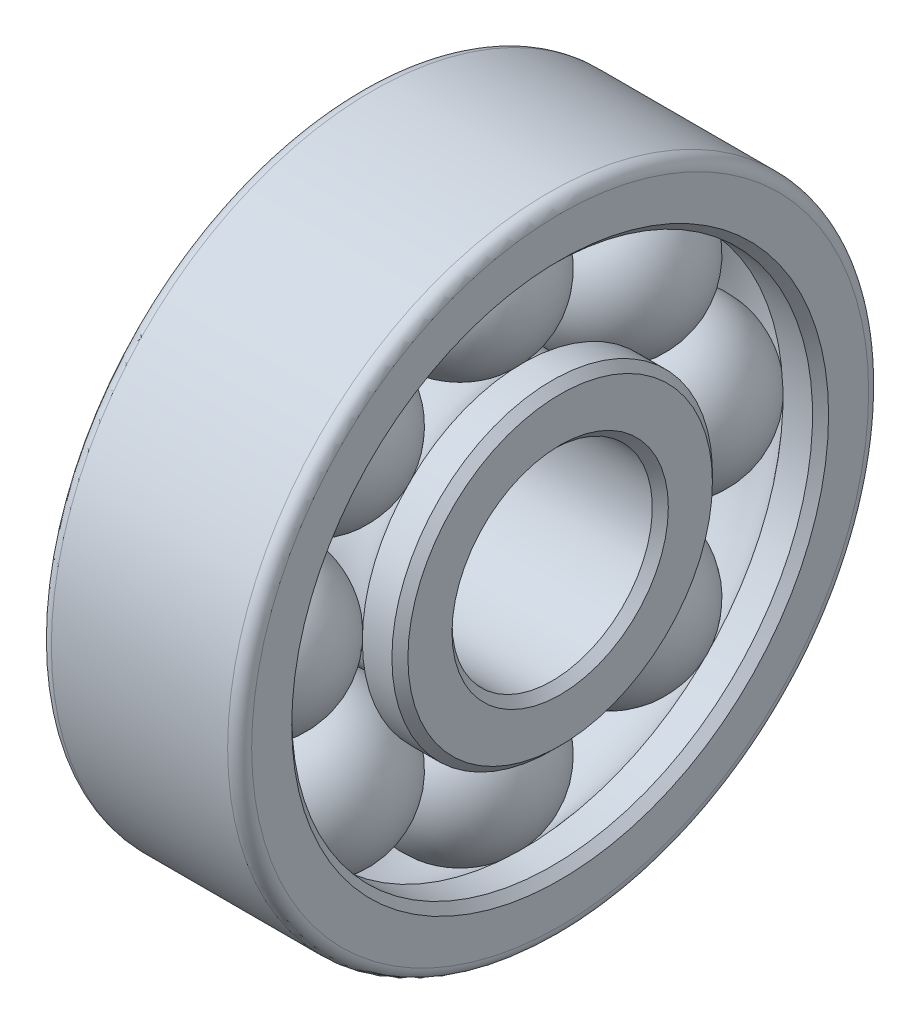
ISO-10303-21;
HEADER;
FILE_DESCRIPTION(('STEP AP214'),'2;1');
FILE_NAME('part.step','',(''),(''),'','','');
FILE_SCHEMA(('AUTOMOTIVE_DESIGN { 1 0 10303 214 1 1 1 1 }'));
ENDSEC;
DATA;
#1=APPLICATION_CONTEXT('core data for automotive mechanical design processes');
#2=APPLICATION_PROTOCOL_DEFINITION('international standard','automotive_design',2000,#1);
#3=PRODUCT_CONTEXT('',#1,'mechanical');
#4=PRODUCT('Part','Part','',(#3));
#5=PRODUCT_RELATED_PRODUCT_CATEGORY('part','',(#4));
#6=PRODUCT_DEFINITION_FORMATION('','',#4);
#7=PRODUCT_DEFINITION_CONTEXT('part definition',#1,'design');
#8=PRODUCT_DEFINITION('design','',#6,#7);
#9=PRODUCT_DEFINITION_SHAPE('','',#8);
#10=(LENGTH_UNIT() NAMED_UNIT(*) SI_UNIT(.MILLI.,.METRE.));
#11=(NAMED_UNIT(*) PLANE_ANGLE_UNIT() SI_UNIT($,.RADIAN.));
#12=(NAMED_UNIT(*) SI_UNIT($,.STERADIAN.) SOLID_ANGLE_UNIT());
#13=UNCERTAINTY_MEASURE_WITH_UNIT(LENGTH_MEASURE(1.E-05),#10,'distance_accuracy_value','');
#14=(GEOMETRIC_REPRESENTATION_CONTEXT(3) GLOBAL_UNCERTAINTY_ASSIGNED_CONTEXT((#13)) GLOBAL_UNIT_ASSIGNED_CONTEXT((#10,
#11,#12)) REPRESENTATION_CONTEXT('',''));
#15=CARTESIAN_POINT('',(0.,0.,0.));
#16=DIRECTION('',(0.,0.,1.));
#17=DIRECTION('',(1.,0.,0.));
#18=AXIS2_PLACEMENT_3D('',#15,#16,#17);
#19=CARTESIAN_POINT('',(2.5,1.21231060122942,3.71231060122933));
#20=DIRECTION('',(0.,0.707106781186556,0.707106781186539));
#21=DIRECTION('',(1.,0.,0.));
#22=AXIS2_PLACEMENT_3D('',#19,#20,#21);
#23=SPHERICAL_SURFACE('',#22,2.);
#24=CARTESIAN_POINT('',(2.5,2.62652416360253,5.12652416360241));
#25=VERTEX_POINT('',#24);
#26=VERTEX_LOOP('',#25);
#27=FACE_BOUND('',#26,.T.);
#28=ADVANCED_FACE('F46',(#27),#23,.T.);
#29=CLOSED_SHELL('',(#28));
#30=MANIFOLD_SOLID_BREP('B2',#29);
#31=CARTESIAN_POINT('',(2.5,-2.49999999999995,5.25));
#32=DIRECTION('',(0.,0.,1.));
#33=DIRECTION('',(1.,0.,0.));
#34=AXIS2_PLACEMENT_3D('',#31,#32,#33);
#35=SPHERICAL_SURFACE('',#34,2.);
#36=CARTESIAN_POINT('',(2.5,-2.49999999999992,7.25));
#37=VERTEX_POINT('',#36);
#38=VERTEX_LOOP('',#37);
#39=FACE_BOUND('',#38,.T.);
#40=ADVANCED_FACE('F70',(#39),#35,.T.);
#41=CLOSED_SHELL('',(#40));
#42=MANIFOLD_SOLID_BREP('B7',#41);
#43=CARTESIAN_POINT('',(2.5,-6.21231060122934,3.71231060122941));
#44=DIRECTION('',(0.,-0.707106781186541,0.707106781186554));
#45=DIRECTION('',(1.,0.,0.));
#46=AXIS2_PLACEMENT_3D('',#43,#44,#45);
#47=SPHERICAL_SURFACE('',#46,2.);
#48=CARTESIAN_POINT('',(2.5,-7.62652416360243,5.12652416360252));
#49=VERTEX_POINT('',#48);
#50=VERTEX_LOOP('',#49);
#51=FACE_BOUND('',#50,.T.);
#52=ADVANCED_FACE('F94',(#51),#47,.T.);
#53=CLOSED_SHELL('',(#52));
#54=MANIFOLD_SOLID_BREP('B42',#53);
#55=CARTESIAN_POINT('',(2.5,-7.75,0.));
#56=DIRECTION('',(0.,-1.,0.));
#57=DIRECTION('',(1.,0.,0.));
#58=AXIS2_PLACEMENT_3D('',#55,#56,#57);
#59=SPHERICAL_SURFACE('',#58,2.);
#60=CARTESIAN_POINT('',(2.5,-9.75,0.));
#61=VERTEX_POINT('',#60);
#62=VERTEX_LOOP('',#61);
#63=FACE_BOUND('',#62,.T.);
#64=ADVANCED_FACE('F118',(#63),#59,.T.);
#65=CLOSED_SHELL('',(#64));
#66=MANIFOLD_SOLID_BREP('B66',#65);
#67=CARTESIAN_POINT('',(2.5,-6.21231060122939,-3.71231060122936));
#68=DIRECTION('',(0.,-0.707106781186551,-0.707106781186544));
#69=DIRECTION('',(1.,0.,0.));
#70=AXIS2_PLACEMENT_3D('',#67,#68,#69);
#71=SPHERICAL_SURFACE('',#70,2.);
#72=CARTESIAN_POINT('',(2.5,-7.6265241636025,-5.12652416360244));
#73=VERTEX_POINT('',#72);
#74=VERTEX_LOOP('',#73);
#75=FACE_BOUND('',#74,.T.);
#76=ADVANCED_FACE('F142',(#75),#71,.T.);
#77=CLOSED_SHELL('',(#76));
#78=MANIFOLD_SOLID_BREP('B90',#77);
#79=CARTESIAN_POINT('',(2.5,-2.50000000000002,-5.25));
#80=DIRECTION('',(0.,0.,-1.));
#81=DIRECTION('',(1.,0.,0.));
#82=AXIS2_PLACEMENT_3D('',#79,#80,#81);
#83=SPHERICAL_SURFACE('',#82,2.);
#84=CARTESIAN_POINT('',(2.5,-2.50000000000003,-7.25));
#85=VERTEX_POINT('',#84);
#86=VERTEX_LOOP('',#85);
#87=FACE_BOUND('',#86,.T.);
#88=ADVANCED_FACE('F166',(#87),#83,.T.);
#89=CLOSED_SHELL('',(#88));
#90=MANIFOLD_SOLID_BREP('B114',#89);
#91=CARTESIAN_POINT('',(2.5,1.21231060122937,-3.71231060122938));
#92=DIRECTION('',(0.,0.707106781186546,-0.707106781186549));
#93=DIRECTION('',(1.,0.,0.));
#94=AXIS2_PLACEMENT_3D('',#91,#92,#93);
#95=SPHERICAL_SURFACE('',#94,2.);
#96=CARTESIAN_POINT('',(2.5,2.62652416360246,-5.12652416360248));
#97=VERTEX_POINT('',#96);
#98=VERTEX_LOOP('',#97);
#99=FACE_BOUND('',#98,.T.);
#100=ADVANCED_FACE('F190',(#99),#95,.T.);
#101=CLOSED_SHELL('',(#100));
#102=MANIFOLD_SOLID_BREP('B138',#101);
#103=CARTESIAN_POINT('',(2.5,2.75,0.));
#104=DIRECTION('',(0.,1.,0.));
#105=DIRECTION('',(1.,0.,0.));
#106=AXIS2_PLACEMENT_3D('',#103,#104,#105);
#107=SPHERICAL_SURFACE('',#106,2.);
#108=CARTESIAN_POINT('',(2.5,4.75,0.));
#109=VERTEX_POINT('',#108);
#110=VERTEX_LOOP('',#109);
#111=FACE_BOUND('',#110,.T.);
#112=ADVANCED_FACE('F216',(#111),#107,.T.);
#113=CLOSED_SHELL('',(#112));
#114=MANIFOLD_SOLID_BREP('B162',#113);
#115=CARTESIAN_POINT('',(0.,4.,0.));
#116=DIRECTION('',(1.,0.,0.));
#117=DIRECTION('',(0.,0.,-1.));
#118=AXIS2_PLACEMENT_3D('',#115,#116,#117);
#119=PLANE('',#118);
#120=CARTESIAN_POINT('',(0.,-2.5,0.));
#121=DIRECTION('',(1.,0.,0.));
#122=DIRECTION('',(0.,0.,-1.));
#123=AXIS2_PLACEMENT_3D('',#120,#121,#122);
#124=CIRCLE('',#123,6.7);
#125=CARTESIAN_POINT('',(0.,-2.5,-6.7));
#126=VERTEX_POINT('',#125);
#127=EDGE_CURVE('E215',#126,#126,#124,.T.);
#128=ORIENTED_EDGE('',*,*,#127,.T.);
#129=EDGE_LOOP('',(#128));
#130=FACE_BOUND('',#129,.T.);
#131=CARTESIAN_POINT('',(0.,-2.5,0.));
#132=DIRECTION('',(1.,0.,0.));
#133=DIRECTION('',(0.,0.,-1.));
#134=AXIS2_PLACEMENT_3D('',#131,#132,#133);
#135=CIRCLE('',#134,7.7);
#136=CARTESIAN_POINT('',(0.,-2.5,-7.7));
#137=VERTEX_POINT('',#136);
#138=EDGE_CURVE('E259',#137,#137,#135,.F.);
#139=ORIENTED_EDGE('',*,*,#138,.T.);
#140=EDGE_LOOP('',(#139));
#141=FACE_BOUND('',#140,.T.);
#142=ADVANCED_FACE('F239',(#130,#141),#119,.F.);
#143=CARTESIAN_POINT('',(-1.0669014084507,-2.5,0.));
#144=DIRECTION('',(-1.,0.,0.));
#145=DIRECTION('',(0.,0.,1.));
#146=AXIS2_PLACEMENT_3D('',#143,#144,#145);
#147=CYLINDRICAL_SURFACE('',#146,6.5);
#148=CARTESIAN_POINT('',(0.200000000000001,-2.5,0.));
#149=DIRECTION('',(1.,0.,0.));
#150=DIRECTION('',(0.,0.,-1.));
#151=AXIS2_PLACEMENT_3D('',#148,#149,#150);
#152=CIRCLE('',#151,6.5);
#153=CARTESIAN_POINT('',(0.200000000000001,-2.5,-6.5));
#154=VERTEX_POINT('',#153);
#155=EDGE_CURVE('E246',#154,#154,#152,.F.);
#156=ORIENTED_EDGE('',*,*,#155,.T.);
#157=EDGE_LOOP('',(#156));
#158=FACE_BOUND('',#157,.T.);
#159=CARTESIAN_POINT('',(0.938750500400401,-2.5,0.));
#160=DIRECTION('',(-1.,0.,0.));
#161=DIRECTION('',(0.,0.,1.));
#162=AXIS2_PLACEMENT_3D('',#159,#160,#161);
#163=CIRCLE('',#162,6.5);
#164=CARTESIAN_POINT('',(0.938750500400401,-2.5,6.5));
#165=VERTEX_POINT('',#164);
#166=EDGE_CURVE('E271',#165,#165,#163,.T.);
#167=ORIENTED_EDGE('',*,*,#166,.F.);
#168=EDGE_LOOP('',(#167));
#169=FACE_BOUND('',#168,.T.);
#170=ADVANCED_FACE('F283',(#158,#169),#147,.F.);
#171=CARTESIAN_POINT('',(2.5,-2.5,0.));
#172=DIRECTION('',(-1.,0.,0.));
#173=DIRECTION('',(0.,0.,1.));
#174=AXIS2_PLACEMENT_3D('',#171,#172,#173);
#175=TOROIDAL_SURFACE('',#174,5.25,2.);
#176=CARTESIAN_POINT('',(4.0612494995996,-2.5,0.));
#177=DIRECTION('',(-1.,0.,0.));
#178=DIRECTION('',(0.,0.,1.));
#179=AXIS2_PLACEMENT_3D('',#176,#177,#178);
#180=CIRCLE('',#179,6.5);
#181=CARTESIAN_POINT('',(4.0612494995996,-2.5,6.5));
#182=VERTEX_POINT('',#181);
#183=EDGE_CURVE('E274',#182,#182,#180,.T.);
#184=ORIENTED_EDGE('',*,*,#183,.F.);
#185=EDGE_LOOP('',(#184));
#186=FACE_BOUND('',#185,.T.);
#187=ORIENTED_EDGE('',*,*,#166,.T.);
#188=EDGE_LOOP('',(#187));
#189=FACE_BOUND('',#188,.T.);
#190=ADVANCED_FACE('F280',(#186,#189),#175,.F.);
#191=CARTESIAN_POINT('',(-1.0669014084507,-2.5,0.));
#192=DIRECTION('',(-1.,0.,0.));
#193=DIRECTION('',(0.,0.,1.));
#194=AXIS2_PLACEMENT_3D('',#191,#192,#193);
#195=CYLINDRICAL_SURFACE('',#194,6.5);
#196=CARTESIAN_POINT('',(4.8,-2.5,0.));
#197=DIRECTION('',(-1.,0.,0.));
#198=DIRECTION('',(0.,0.,1.));
#199=AXIS2_PLACEMENT_3D('',#196,#197,#198);
#200=CIRCLE('',#199,6.5);
#201=CARTESIAN_POINT('',(4.8,-2.5,6.5));
#202=VERTEX_POINT('',#201);
#203=EDGE_CURVE('E250',#202,#202,#200,.F.);
#204=ORIENTED_EDGE('',*,*,#203,.T.);
#205=EDGE_LOOP('',(#204));
#206=FACE_BOUND('',#205,.T.);
#207=ORIENTED_EDGE('',*,*,#183,.T.);
#208=EDGE_LOOP('',(#207));
#209=FACE_BOUND('',#208,.T.);
#210=ADVANCED_FACE('F278',(#206,#209),#195,.F.);
#211=CARTESIAN_POINT('',(5.,4.,0.));
#212=DIRECTION('',(-1.,0.,0.));
#213=DIRECTION('',(0.,0.,1.));
#214=AXIS2_PLACEMENT_3D('',#211,#212,#213);
#215=PLANE('',#214);
#216=CARTESIAN_POINT('',(5.,-2.5,0.));
#217=DIRECTION('',(-1.,0.,0.));
#218=DIRECTION('',(0.,0.,1.));
#219=AXIS2_PLACEMENT_3D('',#216,#217,#218);
#220=CIRCLE('',#219,6.7);
#221=CARTESIAN_POINT('',(5.,-2.5,6.7));
#222=VERTEX_POINT('',#221);
#223=EDGE_CURVE('E254',#222,#222,#220,.T.);
#224=ORIENTED_EDGE('',*,*,#223,.T.);
#225=EDGE_LOOP('',(#224));
#226=FACE_BOUND('',#225,.T.);
#227=CARTESIAN_POINT('',(5.,-2.5,0.));
#228=DIRECTION('',(-1.,0.,0.));
#229=DIRECTION('',(0.,0.,1.));
#230=AXIS2_PLACEMENT_3D('',#227,#228,#229);
#231=CIRCLE('',#230,7.7);
#232=CARTESIAN_POINT('',(5.,-2.5,7.7));
#233=VERTEX_POINT('',#232);
#234=EDGE_CURVE('E262',#233,#233,#231,.F.);
#235=ORIENTED_EDGE('',*,*,#234,.T.);
#236=EDGE_LOOP('',(#235));
#237=FACE_BOUND('',#236,.T.);
#238=ADVANCED_FACE('F314',(#226,#237),#215,.F.);
#239=CARTESIAN_POINT('',(-1.0669014084507,-2.5,0.));
#240=DIRECTION('',(-1.,0.,0.));
#241=DIRECTION('',(0.,0.,1.));
#242=AXIS2_PLACEMENT_3D('',#239,#240,#241);
#243=CYLINDRICAL_SURFACE('',#242,8.);
#244=CARTESIAN_POINT('',(4.7,-2.5,0.));
#245=DIRECTION('',(-1.,0.,0.));
#246=DIRECTION('',(0.,0.,1.));
#247=AXIS2_PLACEMENT_3D('',#244,#245,#246);
#248=CIRCLE('',#247,8.);
#249=CARTESIAN_POINT('',(4.7,-2.5,8.));
#250=VERTEX_POINT('',#249);
#251=EDGE_CURVE('E265',#250,#250,#248,.T.);
#252=ORIENTED_EDGE('',*,*,#251,.T.);
#253=EDGE_LOOP('',(#252));
#254=FACE_BOUND('',#253,.T.);
#255=CARTESIAN_POINT('',(0.3,-2.5,0.));
#256=DIRECTION('',(1.,0.,0.));
#257=DIRECTION('',(0.,0.,-1.));
#258=AXIS2_PLACEMENT_3D('',#255,#256,#257);
#259=CIRCLE('',#258,8.);
#260=CARTESIAN_POINT('',(0.3,-2.5,-8.));
#261=VERTEX_POINT('',#260);
#262=EDGE_CURVE('E268',#261,#261,#259,.T.);
#263=ORIENTED_EDGE('',*,*,#262,.T.);
#264=EDGE_LOOP('',(#263));
#265=FACE_BOUND('',#264,.T.);
#266=ADVANCED_FACE('F299',(#254,#265),#243,.T.);
#267=CARTESIAN_POINT('',(4.7,-2.5,0.));
#268=DIRECTION('',(-1.,0.,0.));
#269=DIRECTION('',(0.,0.,1.));
#270=AXIS2_PLACEMENT_3D('',#267,#268,#269);
#271=TOROIDAL_SURFACE('',#270,7.7,0.3);
#272=ORIENTED_EDGE('',*,*,#234,.F.);
#273=EDGE_LOOP('',(#272));
#274=FACE_BOUND('',#273,.T.);
#275=ORIENTED_EDGE('',*,*,#251,.F.);
#276=EDGE_LOOP('',(#275));
#277=FACE_BOUND('',#276,.T.);
#278=ADVANCED_FACE('F295',(#274,#277),#271,.T.);
#279=CARTESIAN_POINT('',(0.3,-2.5,0.));
#280=DIRECTION('',(1.,0.,0.));
#281=DIRECTION('',(0.,0.,-1.));
#282=AXIS2_PLACEMENT_3D('',#279,#280,#281);
#283=TOROIDAL_SURFACE('',#282,7.7,0.3);
#284=ORIENTED_EDGE('',*,*,#262,.F.);
#285=EDGE_LOOP('',(#284));
#286=FACE_BOUND('',#285,.T.);
#287=ORIENTED_EDGE('',*,*,#138,.F.);
#288=EDGE_LOOP('',(#287));
#289=FACE_BOUND('',#288,.T.);
#290=ADVANCED_FACE('F298',(#286,#289),#283,.T.);
#291=CARTESIAN_POINT('',(5.,-2.5,0.));
#292=DIRECTION('',(1.,0.,0.));
#293=DIRECTION('',(0.,0.,-1.));
#294=AXIS2_PLACEMENT_3D('',#291,#292,#293);
#295=CONICAL_SURFACE('',#294,6.7,0.78539816339744);
#296=ORIENTED_EDGE('',*,*,#203,.F.);
#297=EDGE_LOOP('',(#296));
#298=FACE_BOUND('',#297,.T.);
#299=ORIENTED_EDGE('',*,*,#223,.F.);
#300=EDGE_LOOP('',(#299));
#301=FACE_BOUND('',#300,.T.);
#302=ADVANCED_FACE('F302',(#298,#301),#295,.F.);
#303=CARTESIAN_POINT('',(0.200000000000001,-2.5,0.));
#304=DIRECTION('',(-1.,0.,0.));
#305=DIRECTION('',(0.,0.,1.));
#306=AXIS2_PLACEMENT_3D('',#303,#304,#305);
#307=CONICAL_SURFACE('',#306,6.5,0.785398163397446);
#308=ORIENTED_EDGE('',*,*,#127,.F.);
#309=EDGE_LOOP('',(#308));
#310=FACE_BOUND('',#309,.T.);
#311=ORIENTED_EDGE('',*,*,#155,.F.);
#312=EDGE_LOOP('',(#311));
#313=FACE_BOUND('',#312,.T.);
#314=ADVANCED_FACE('F241',(#310,#313),#307,.F.);
#315=CLOSED_SHELL('',(#142,#170,#190,#210,#238,#266,#278,#290,#302,#314));
#316=MANIFOLD_SOLID_BREP('B186',#315);
#317=CARTESIAN_POINT('',(0.,0.,0.));
#318=DIRECTION('',(1.,0.,0.));
#319=DIRECTION('',(0.,0.,-1.));
#320=AXIS2_PLACEMENT_3D('',#317,#318,#319);
#321=PLANE('',#320);
#322=CARTESIAN_POINT('',(0.,-2.5,0.));
#323=DIRECTION('',(1.,0.,0.));
#324=DIRECTION('',(0.,0.,-1.));
#325=AXIS2_PLACEMENT_3D('',#322,#323,#324);
#326=CIRCLE('',#325,2.7);
#327=CARTESIAN_POINT('',(0.,-2.5,-2.7));
#328=VERTEX_POINT('',#327);
#329=EDGE_CURVE('E417',#328,#328,#326,.T.);
#330=ORIENTED_EDGE('',*,*,#329,.T.);
#331=EDGE_LOOP('',(#330));
#332=FACE_BOUND('',#331,.T.);
#333=CARTESIAN_POINT('',(0.,-2.5,0.));
#334=DIRECTION('',(1.,0.,0.));
#335=DIRECTION('',(0.,0.,-1.));
#336=AXIS2_PLACEMENT_3D('',#333,#334,#335);
#337=CIRCLE('',#336,3.8);
#338=CARTESIAN_POINT('',(0.,-2.5,-3.8));
#339=VERTEX_POINT('',#338);
#340=EDGE_CURVE('E420',#339,#339,#337,.F.);
#341=ORIENTED_EDGE('',*,*,#340,.T.);
#342=EDGE_LOOP('',(#341));
#343=FACE_BOUND('',#342,.T.);
#344=ADVANCED_FACE('F397',(#332,#343),#321,.F.);
#345=CARTESIAN_POINT('',(-1.0669014084507,-2.5,0.));
#346=DIRECTION('',(-1.,0.,0.));
#347=DIRECTION('',(0.,0.,1.));
#348=AXIS2_PLACEMENT_3D('',#345,#346,#347);
#349=CYLINDRICAL_SURFACE('',#348,2.5);
#350=CARTESIAN_POINT('',(0.199999999999994,-2.5,0.));
#351=DIRECTION('',(1.,0.,0.));
#352=DIRECTION('',(0.,0.,-1.));
#353=AXIS2_PLACEMENT_3D('',#350,#351,#352);
#354=CIRCLE('',#353,2.5);
#355=CARTESIAN_POINT('',(0.199999999999994,-2.5,-2.5));
#356=VERTEX_POINT('',#355);
#357=EDGE_CURVE('E423',#356,#356,#354,.F.);
#358=ORIENTED_EDGE('',*,*,#357,.T.);
#359=EDGE_LOOP('',(#358));
#360=FACE_BOUND('',#359,.T.);
#361=CARTESIAN_POINT('',(4.8,-2.5,0.));
#362=DIRECTION('',(-1.,0.,0.));
#363=DIRECTION('',(0.,0.,1.));
#364=AXIS2_PLACEMENT_3D('',#361,#362,#363);
#365=CIRCLE('',#364,2.5);
#366=CARTESIAN_POINT('',(4.8,-2.5,2.5));
#367=VERTEX_POINT('',#366);
#368=EDGE_CURVE('E426',#367,#367,#365,.F.);
#369=ORIENTED_EDGE('',*,*,#368,.T.);
#370=EDGE_LOOP('',(#369));
#371=FACE_BOUND('',#370,.T.);
#372=ADVANCED_FACE('F451',(#360,#371),#349,.F.);
#373=CARTESIAN_POINT('',(5.,0.,0.));
#374=DIRECTION('',(-1.,0.,0.));
#375=DIRECTION('',(0.,0.,1.));
#376=AXIS2_PLACEMENT_3D('',#373,#374,#375);
#377=PLANE('',#376);
#378=CARTESIAN_POINT('',(5.,-2.5,0.));
#379=DIRECTION('',(-1.,0.,0.));
#380=DIRECTION('',(0.,0.,1.));
#381=AXIS2_PLACEMENT_3D('',#378,#379,#380);
#382=CIRCLE('',#381,2.7);
#383=CARTESIAN_POINT('',(5.,-2.5,2.7));
#384=VERTEX_POINT('',#383);
#385=EDGE_CURVE('E408',#384,#384,#382,.T.);
#386=ORIENTED_EDGE('',*,*,#385,.T.);
#387=EDGE_LOOP('',(#386));
#388=FACE_BOUND('',#387,.T.);
#389=CARTESIAN_POINT('',(5.,-2.5,0.));
#390=DIRECTION('',(-1.,0.,0.));
#391=DIRECTION('',(0.,0.,1.));
#392=AXIS2_PLACEMENT_3D('',#389,#390,#391);
#393=CIRCLE('',#392,3.8);
#394=CARTESIAN_POINT('',(5.,-2.5,3.8));
#395=VERTEX_POINT('',#394);
#396=EDGE_CURVE('E412',#395,#395,#393,.F.);
#397=ORIENTED_EDGE('',*,*,#396,.T.);
#398=EDGE_LOOP('',(#397));
#399=FACE_BOUND('',#398,.T.);
#400=ADVANCED_FACE('F446',(#388,#399),#377,.F.);
#401=CARTESIAN_POINT('',(-1.0669014084507,-2.5,0.));
#402=DIRECTION('',(-1.,0.,0.));
#403=DIRECTION('',(0.,0.,1.));
#404=AXIS2_PLACEMENT_3D('',#401,#402,#403);
#405=CYLINDRICAL_SURFACE('',#404,4.);
#406=CARTESIAN_POINT('',(4.8,-2.5,0.));
#407=DIRECTION('',(-1.,0.,0.));
#408=DIRECTION('',(0.,0.,1.));
#409=AXIS2_PLACEMENT_3D('',#406,#407,#408);
#410=CIRCLE('',#409,4.);
#411=CARTESIAN_POINT('',(4.8,-2.5,4.));
#412=VERTEX_POINT('',#411);
#413=EDGE_CURVE('E404',#412,#412,#410,.T.);
#414=ORIENTED_EDGE('',*,*,#413,.T.);
#415=EDGE_LOOP('',(#414));
#416=FACE_BOUND('',#415,.T.);
#417=CARTESIAN_POINT('',(4.0612494995996,-2.5,0.));
#418=DIRECTION('',(-1.,0.,0.));
#419=DIRECTION('',(0.,0.,1.));
#420=AXIS2_PLACEMENT_3D('',#417,#418,#419);
#421=CIRCLE('',#420,4.);
#422=CARTESIAN_POINT('',(4.0612494995996,-2.5,4.));
#423=VERTEX_POINT('',#422);
#424=EDGE_CURVE('E429',#423,#423,#421,.T.);
#425=ORIENTED_EDGE('',*,*,#424,.F.);
#426=EDGE_LOOP('',(#425));
#427=FACE_BOUND('',#426,.T.);
#428=ADVANCED_FACE('F441',(#416,#427),#405,.T.);
#429=CARTESIAN_POINT('',(2.5,-2.5,0.));
#430=DIRECTION('',(-1.,0.,0.));
#431=DIRECTION('',(0.,0.,1.));
#432=AXIS2_PLACEMENT_3D('',#429,#430,#431);
#433=TOROIDAL_SURFACE('',#432,5.25,2.);
#434=CARTESIAN_POINT('',(0.938750500400399,-2.5,0.));
#435=DIRECTION('',(-1.,0.,0.));
#436=DIRECTION('',(0.,0.,1.));
#437=AXIS2_PLACEMENT_3D('',#434,#435,#436);
#438=CIRCLE('',#437,4.);
#439=CARTESIAN_POINT('',(0.938750500400399,-2.5,4.));
#440=VERTEX_POINT('',#439);
#441=EDGE_CURVE('E432',#440,#440,#438,.T.);
#442=ORIENTED_EDGE('',*,*,#441,.F.);
#443=EDGE_LOOP('',(#442));
#444=FACE_BOUND('',#443,.T.);
#445=ORIENTED_EDGE('',*,*,#424,.T.);
#446=EDGE_LOOP('',(#445));
#447=FACE_BOUND('',#446,.T.);
#448=ADVANCED_FACE('F438',(#444,#447),#433,.F.);
#449=CARTESIAN_POINT('',(-1.0669014084507,-2.5,0.));
#450=DIRECTION('',(-1.,0.,0.));
#451=DIRECTION('',(0.,0.,1.));
#452=AXIS2_PLACEMENT_3D('',#449,#450,#451);
#453=CYLINDRICAL_SURFACE('',#452,4.);
#454=CARTESIAN_POINT('',(0.200000000000001,-2.5,0.));
#455=DIRECTION('',(1.,0.,0.));
#456=DIRECTION('',(0.,0.,-1.));
#457=AXIS2_PLACEMENT_3D('',#454,#455,#456);
#458=CIRCLE('',#457,4.);
#459=CARTESIAN_POINT('',(0.200000000000001,-2.5,-4.));
#460=VERTEX_POINT('',#459);
#461=EDGE_CURVE('E238',#460,#460,#458,.T.);
#462=ORIENTED_EDGE('',*,*,#461,.T.);
#463=EDGE_LOOP('',(#462));
#464=FACE_BOUND('',#463,.T.);
#465=ORIENTED_EDGE('',*,*,#441,.T.);
#466=EDGE_LOOP('',(#465));
#467=FACE_BOUND('',#466,.T.);
#468=ADVANCED_FACE('F436',(#464,#467),#453,.T.);
#469=CARTESIAN_POINT('',(0.199999999999994,-2.5,0.));
#470=DIRECTION('',(-1.,0.,0.));
#471=DIRECTION('',(0.,0.,1.));
#472=AXIS2_PLACEMENT_3D('',#469,#470,#471);
#473=CONICAL_SURFACE('',#472,2.5,0.785398163397453);
#474=ORIENTED_EDGE('',*,*,#329,.F.);
#475=EDGE_LOOP('',(#474));
#476=FACE_BOUND('',#475,.T.);
#477=ORIENTED_EDGE('',*,*,#357,.F.);
#478=EDGE_LOOP('',(#477));
#479=FACE_BOUND('',#478,.T.);
#480=ADVANCED_FACE('F464',(#476,#479),#473,.F.);
#481=CARTESIAN_POINT('',(5.,-2.5,0.));
#482=DIRECTION('',(1.,0.,0.));
#483=DIRECTION('',(0.,0.,-1.));
#484=AXIS2_PLACEMENT_3D('',#481,#482,#483);
#485=CONICAL_SURFACE('',#484,2.7,0.785398163397442);
#486=ORIENTED_EDGE('',*,*,#368,.F.);
#487=EDGE_LOOP('',(#486));
#488=FACE_BOUND('',#487,.T.);
#489=ORIENTED_EDGE('',*,*,#385,.F.);
#490=EDGE_LOOP('',(#489));
#491=FACE_BOUND('',#490,.T.);
#492=ADVANCED_FACE('F467',(#488,#491),#485,.F.);
#493=CARTESIAN_POINT('',(4.8,-2.5,0.));
#494=DIRECTION('',(-1.,0.,0.));
#495=DIRECTION('',(0.,0.,1.));
#496=AXIS2_PLACEMENT_3D('',#493,#494,#495);
#497=CONICAL_SURFACE('',#496,4.,0.78539816339745);
#498=ORIENTED_EDGE('',*,*,#396,.F.);
#499=EDGE_LOOP('',(#498));
#500=FACE_BOUND('',#499,.T.);
#501=ORIENTED_EDGE('',*,*,#413,.F.);
#502=EDGE_LOOP('',(#501));
#503=FACE_BOUND('',#502,.T.);
#504=ADVANCED_FACE('F470',(#500,#503),#497,.T.);
#505=CARTESIAN_POINT('',(0.,-2.5,0.));
#506=DIRECTION('',(1.,0.,0.));
#507=DIRECTION('',(0.,0.,-1.));
#508=AXIS2_PLACEMENT_3D('',#505,#506,#507);
#509=CONICAL_SURFACE('',#508,3.8,0.785398163397453);
#510=ORIENTED_EDGE('',*,*,#461,.F.);
#511=EDGE_LOOP('',(#510));
#512=FACE_BOUND('',#511,.T.);
#513=ORIENTED_EDGE('',*,*,#340,.F.);
#514=EDGE_LOOP('',(#513));
#515=FACE_BOUND('',#514,.T.);
#516=ADVANCED_FACE('F399',(#512,#515),#509,.T.);
#517=CLOSED_SHELL('',(#344,#372,#400,#428,#448,#468,#480,#492,#504,#516));
#518=MANIFOLD_SOLID_BREP('B210',#517);
#519=ADVANCED_BREP_SHAPE_REPRESENTATION('',(#18,#30,#42,#54,#66,#78,#90,#102,#114,#316,#518),#14);
#520=SHAPE_DEFINITION_REPRESENTATION(#9,#519);
ENDSEC;
END-ISO-10303-21;
